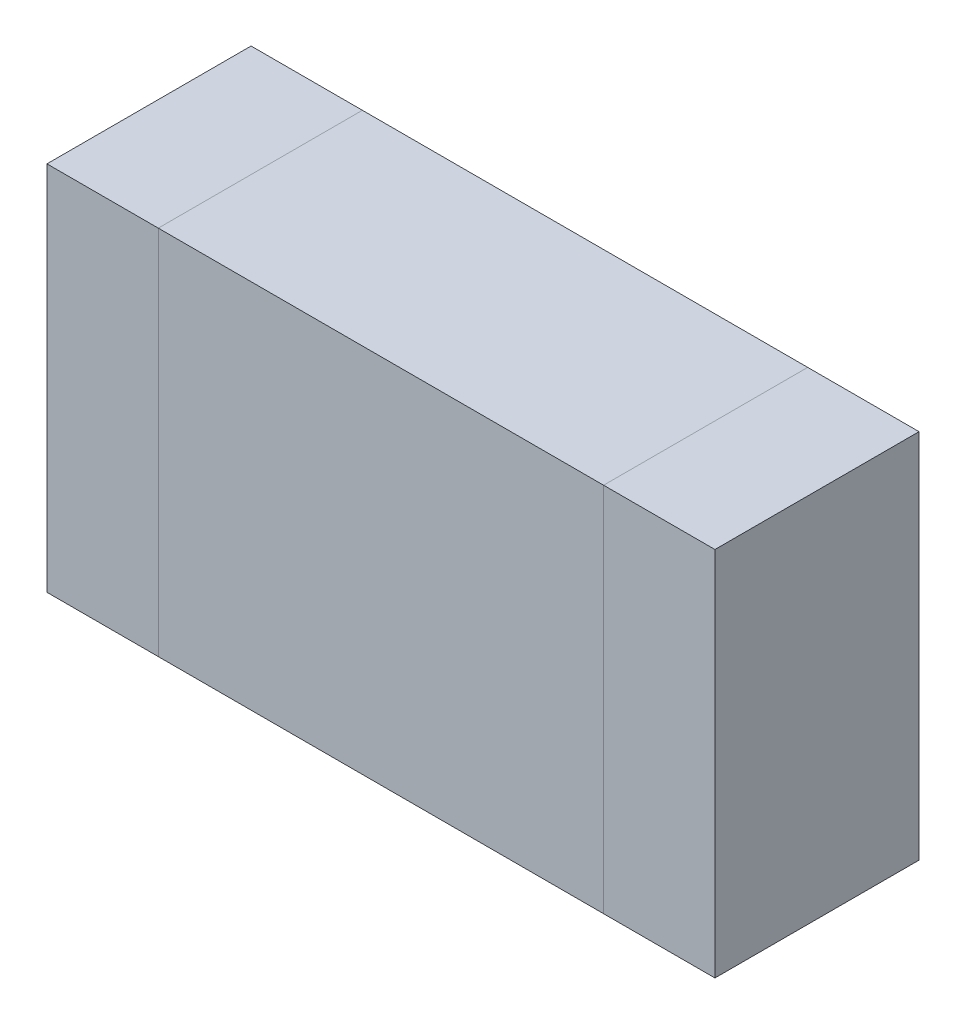
ISO-10303-21;
HEADER;
FILE_DESCRIPTION(('STEP AP214'),'2;1');
FILE_NAME('part.step','',(''),(''),'','','');
FILE_SCHEMA(('AUTOMOTIVE_DESIGN { 1 0 10303 214 1 1 1 1 }'));
ENDSEC;
DATA;
#1=APPLICATION_CONTEXT('core data for automotive mechanical design processes');
#2=APPLICATION_PROTOCOL_DEFINITION('international standard','automotive_design',2000,#1);
#3=PRODUCT_CONTEXT('',#1,'mechanical');
#4=PRODUCT('Part','Part','',(#3));
#5=PRODUCT_RELATED_PRODUCT_CATEGORY('part','',(#4));
#6=PRODUCT_DEFINITION_FORMATION('','',#4);
#7=PRODUCT_DEFINITION_CONTEXT('part definition',#1,'design');
#8=PRODUCT_DEFINITION('design','',#6,#7);
#9=PRODUCT_DEFINITION_SHAPE('','',#8);
#10=(LENGTH_UNIT() NAMED_UNIT(*) SI_UNIT(.MILLI.,.METRE.));
#11=(NAMED_UNIT(*) PLANE_ANGLE_UNIT() SI_UNIT($,.RADIAN.));
#12=(NAMED_UNIT(*) SI_UNIT($,.STERADIAN.) SOLID_ANGLE_UNIT());
#13=UNCERTAINTY_MEASURE_WITH_UNIT(LENGTH_MEASURE(1.E-05),#10,'distance_accuracy_value','');
#14=(GEOMETRIC_REPRESENTATION_CONTEXT(3) GLOBAL_UNCERTAINTY_ASSIGNED_CONTEXT((#13)) GLOBAL_UNIT_ASSIGNED_CONTEXT((#10,
#11,#12)) REPRESENTATION_CONTEXT('',''));
#15=CARTESIAN_POINT('',(0.,0.,0.));
#16=DIRECTION('',(0.,0.,1.));
#17=DIRECTION('',(1.,0.,0.));
#18=AXIS2_PLACEMENT_3D('',#15,#16,#17);
#19=CARTESIAN_POINT('',(-0.5999988,0.50000154,0.));
#20=DIRECTION('',(1.,0.,0.));
#21=DIRECTION('',(0.,-1.,0.));
#22=AXIS2_PLACEMENT_3D('',#19,#20,#21);
#23=PLANE('',#22);
#24=DIRECTION('',(0.,-1.,0.));
#25=VECTOR('',#24,1.);
#26=CARTESIAN_POINT('',(-0.5999988,0.50000154,0.));
#27=LINE('',#26,#25);
#28=CARTESIAN_POINT('',(-0.5999988,0.50000154,0.));
#29=VERTEX_POINT('',#28);
#30=CARTESIAN_POINT('',(-0.5999988,-0.499999,0.));
#31=VERTEX_POINT('',#30);
#32=EDGE_CURVE('P0_E11',#29,#31,#27,.T.);
#33=ORIENTED_EDGE('',*,*,#32,.T.);
#34=DIRECTION('',(0.,0.,1.));
#35=VECTOR('',#34,1.);
#36=CARTESIAN_POINT('',(-0.5999988,-0.499999,0.));
#37=LINE('',#36,#35);
#38=CARTESIAN_POINT('',(-0.5999988,-0.499999,0.5499989));
#39=VERTEX_POINT('',#38);
#40=EDGE_CURVE('P0_E24',#31,#39,#37,.T.);
#41=ORIENTED_EDGE('',*,*,#40,.T.);
#42=DIRECTION('',(0.,-1.,0.));
#43=VECTOR('',#42,1.);
#44=CARTESIAN_POINT('',(-0.5999988,0.50000154,0.5499989));
#45=LINE('',#44,#43);
#46=CARTESIAN_POINT('',(-0.5999988,0.50000154,0.5499989));
#47=VERTEX_POINT('',#46);
#48=EDGE_CURVE('P0_E87',#47,#39,#45,.T.);
#49=ORIENTED_EDGE('',*,*,#48,.F.);
#50=DIRECTION('',(0.,0.,1.));
#51=VECTOR('',#50,1.);
#52=CARTESIAN_POINT('',(-0.5999988,0.50000154,0.));
#53=LINE('',#52,#51);
#54=EDGE_CURVE('P0_E36',#29,#47,#53,.T.);
#55=ORIENTED_EDGE('',*,*,#54,.F.);
#56=EDGE_LOOP('',(#33,#41,#49,#55));
#57=FACE_BOUND('',#56,.T.);
#58=ADVANCED_FACE('P0_F17',(#57),#23,.F.);
#59=CARTESIAN_POINT('',(-0.5999988,-0.499999,0.));
#60=DIRECTION('',(0.,1.,0.));
#61=DIRECTION('',(1.,0.,0.));
#62=AXIS2_PLACEMENT_3D('',#59,#60,#61);
#63=PLANE('',#62);
#64=DIRECTION('',(1.,0.,0.));
#65=VECTOR('',#64,1.);
#66=CARTESIAN_POINT('',(-0.5999988,-0.499999,0.));
#67=LINE('',#66,#65);
#68=CARTESIAN_POINT('',(0.60000134,-0.499999,0.));
#69=VERTEX_POINT('',#68);
#70=EDGE_CURVE('P0_E84',#31,#69,#67,.T.);
#71=ORIENTED_EDGE('',*,*,#70,.T.);
#72=DIRECTION('',(0.,0.,1.));
#73=VECTOR('',#72,1.);
#74=CARTESIAN_POINT('',(0.60000134,-0.499999,0.));
#75=LINE('',#74,#73);
#76=CARTESIAN_POINT('',(0.60000134,-0.499999,0.5499989));
#77=VERTEX_POINT('',#76);
#78=EDGE_CURVE('P0_E82',#69,#77,#75,.T.);
#79=ORIENTED_EDGE('',*,*,#78,.T.);
#80=DIRECTION('',(1.,0.,0.));
#81=VECTOR('',#80,1.);
#82=CARTESIAN_POINT('',(-0.5999988,-0.499999,0.5499989));
#83=LINE('',#82,#81);
#84=EDGE_CURVE('P0_E62',#39,#77,#83,.T.);
#85=ORIENTED_EDGE('',*,*,#84,.F.);
#86=ORIENTED_EDGE('',*,*,#40,.F.);
#87=EDGE_LOOP('',(#71,#79,#85,#86));
#88=FACE_BOUND('',#87,.T.);
#89=ADVANCED_FACE('P0_F89',(#88),#63,.F.);
#90=CARTESIAN_POINT('',(0.60000134,-0.499999,0.));
#91=DIRECTION('',(-1.,0.,0.));
#92=DIRECTION('',(0.,1.,0.));
#93=AXIS2_PLACEMENT_3D('',#90,#91,#92);
#94=PLANE('',#93);
#95=DIRECTION('',(0.,1.,0.));
#96=VECTOR('',#95,1.);
#97=CARTESIAN_POINT('',(0.60000134,-0.499999,0.));
#98=LINE('',#97,#96);
#99=CARTESIAN_POINT('',(0.60000134,0.50000154,0.));
#100=VERTEX_POINT('',#99);
#101=EDGE_CURVE('P0_E71',#69,#100,#98,.T.);
#102=ORIENTED_EDGE('',*,*,#101,.T.);
#103=DIRECTION('',(0.,0.,1.));
#104=VECTOR('',#103,1.);
#105=CARTESIAN_POINT('',(0.60000134,0.50000154,0.));
#106=LINE('',#105,#104);
#107=CARTESIAN_POINT('',(0.60000134,0.50000154,0.5499989));
#108=VERTEX_POINT('',#107);
#109=EDGE_CURVE('P0_E65',#100,#108,#106,.T.);
#110=ORIENTED_EDGE('',*,*,#109,.T.);
#111=DIRECTION('',(0.,1.,0.));
#112=VECTOR('',#111,1.);
#113=CARTESIAN_POINT('',(0.60000134,-0.499999,0.5499989));
#114=LINE('',#113,#112);
#115=EDGE_CURVE('P0_E57',#77,#108,#114,.T.);
#116=ORIENTED_EDGE('',*,*,#115,.F.);
#117=ORIENTED_EDGE('',*,*,#78,.F.);
#118=EDGE_LOOP('',(#102,#110,#116,#117));
#119=FACE_BOUND('',#118,.T.);
#120=ADVANCED_FACE('P0_F69',(#119),#94,.F.);
#121=CARTESIAN_POINT('',(0.60000134,0.50000154,0.));
#122=DIRECTION('',(0.,-1.,0.));
#123=DIRECTION('',(-1.,0.,0.));
#124=AXIS2_PLACEMENT_3D('',#121,#122,#123);
#125=PLANE('',#124);
#126=DIRECTION('',(-1.,0.,0.));
#127=VECTOR('',#126,1.);
#128=CARTESIAN_POINT('',(0.60000134,0.50000154,0.));
#129=LINE('',#128,#127);
#130=EDGE_CURVE('P0_E66',#100,#29,#129,.T.);
#131=ORIENTED_EDGE('',*,*,#130,.T.);
#132=ORIENTED_EDGE('',*,*,#54,.T.);
#133=DIRECTION('',(-1.,0.,0.));
#134=VECTOR('',#133,1.);
#135=CARTESIAN_POINT('',(0.60000134,0.50000154,0.5499989));
#136=LINE('',#135,#134);
#137=EDGE_CURVE('P0_E61',#108,#47,#136,.T.);
#138=ORIENTED_EDGE('',*,*,#137,.F.);
#139=ORIENTED_EDGE('',*,*,#109,.F.);
#140=EDGE_LOOP('',(#131,#132,#138,#139));
#141=FACE_BOUND('',#140,.T.);
#142=ADVANCED_FACE('P0_F76',(#141),#125,.F.);
#143=CARTESIAN_POINT('',(1.270000012699E-06,1.270000012699E-06,0.));
#144=DIRECTION('',(0.,0.,1.));
#145=DIRECTION('',(1.,0.,0.));
#146=AXIS2_PLACEMENT_3D('',#143,#144,#145);
#147=PLANE('',#146);
#148=ORIENTED_EDGE('',*,*,#130,.F.);
#149=ORIENTED_EDGE('',*,*,#101,.F.);
#150=ORIENTED_EDGE('',*,*,#70,.F.);
#151=ORIENTED_EDGE('',*,*,#32,.F.);
#152=EDGE_LOOP('',(#148,#149,#150,#151));
#153=FACE_BOUND('',#152,.T.);
#154=ADVANCED_FACE('P0_F91',(#153),#147,.F.);
#155=CARTESIAN_POINT('',(1.270000012699E-06,1.270000012699E-06,0.5499989));
#156=DIRECTION('',(0.,0.,1.));
#157=DIRECTION('',(1.,0.,0.));
#158=AXIS2_PLACEMENT_3D('',#155,#156,#157);
#159=PLANE('',#158);
#160=ORIENTED_EDGE('',*,*,#48,.T.);
#161=ORIENTED_EDGE('',*,*,#84,.T.);
#162=ORIENTED_EDGE('',*,*,#115,.T.);
#163=ORIENTED_EDGE('',*,*,#137,.T.);
#164=EDGE_LOOP('',(#160,#161,#162,#163));
#165=FACE_BOUND('',#164,.T.);
#166=ADVANCED_FACE('P0_F59',(#165),#159,.T.);
#167=CLOSED_SHELL('',(#58,#89,#120,#142,#154,#166));
#168=MANIFOLD_SOLID_BREP('P0_B1',#167);
#169=CARTESIAN_POINT('',(-0.8999982,0.50000154,0.));
#170=DIRECTION('',(1.,0.,0.));
#171=DIRECTION('',(0.,-1.,0.));
#172=AXIS2_PLACEMENT_3D('',#169,#170,#171);
#173=PLANE('',#172);
#174=DIRECTION('',(0.,-1.,0.));
#175=VECTOR('',#174,1.);
#176=CARTESIAN_POINT('',(-0.8999982,0.50000154,0.));
#177=LINE('',#176,#175);
#178=CARTESIAN_POINT('',(-0.8999982,0.50000154,0.));
#179=VERTEX_POINT('',#178);
#180=CARTESIAN_POINT('',(-0.8999982,-0.499999,0.));
#181=VERTEX_POINT('',#180);
#182=EDGE_CURVE('P1_E11',#179,#181,#177,.T.);
#183=ORIENTED_EDGE('',*,*,#182,.T.);
#184=DIRECTION('',(0.,0.,1.));
#185=VECTOR('',#184,1.);
#186=CARTESIAN_POINT('',(-0.8999982,-0.499999,0.));
#187=LINE('',#186,#185);
#188=CARTESIAN_POINT('',(-0.8999982,-0.499999,0.5499989));
#189=VERTEX_POINT('',#188);
#190=EDGE_CURVE('P1_E24',#181,#189,#187,.T.);
#191=ORIENTED_EDGE('',*,*,#190,.T.);
#192=DIRECTION('',(0.,-1.,0.));
#193=VECTOR('',#192,1.);
#194=CARTESIAN_POINT('',(-0.8999982,0.50000154,0.5499989));
#195=LINE('',#194,#193);
#196=CARTESIAN_POINT('',(-0.8999982,0.50000154,0.5499989));
#197=VERTEX_POINT('',#196);
#198=EDGE_CURVE('P1_E87',#197,#189,#195,.T.);
#199=ORIENTED_EDGE('',*,*,#198,.F.);
#200=DIRECTION('',(0.,0.,1.));
#201=VECTOR('',#200,1.);
#202=CARTESIAN_POINT('',(-0.8999982,0.50000154,0.));
#203=LINE('',#202,#201);
#204=EDGE_CURVE('P1_E36',#179,#197,#203,.T.);
#205=ORIENTED_EDGE('',*,*,#204,.F.);
#206=EDGE_LOOP('',(#183,#191,#199,#205));
#207=FACE_BOUND('',#206,.T.);
#208=ADVANCED_FACE('P1_F17',(#207),#173,.F.);
#209=CARTESIAN_POINT('',(-0.8999982,-0.499999,0.));
#210=DIRECTION('',(0.,1.,0.));
#211=DIRECTION('',(1.,0.,0.));
#212=AXIS2_PLACEMENT_3D('',#209,#210,#211);
#213=PLANE('',#212);
#214=DIRECTION('',(1.,0.,0.));
#215=VECTOR('',#214,1.);
#216=CARTESIAN_POINT('',(-0.8999982,-0.499999,0.));
#217=LINE('',#216,#215);
#218=CARTESIAN_POINT('',(-0.5999988,-0.499999,0.));
#219=VERTEX_POINT('',#218);
#220=EDGE_CURVE('P1_E84',#181,#219,#217,.T.);
#221=ORIENTED_EDGE('',*,*,#220,.T.);
#222=DIRECTION('',(0.,0.,1.));
#223=VECTOR('',#222,1.);
#224=CARTESIAN_POINT('',(-0.5999988,-0.499999,0.));
#225=LINE('',#224,#223);
#226=CARTESIAN_POINT('',(-0.5999988,-0.499999,0.5499989));
#227=VERTEX_POINT('',#226);
#228=EDGE_CURVE('P1_E82',#219,#227,#225,.T.);
#229=ORIENTED_EDGE('',*,*,#228,.T.);
#230=DIRECTION('',(1.,0.,0.));
#231=VECTOR('',#230,1.);
#232=CARTESIAN_POINT('',(-0.8999982,-0.499999,0.5499989));
#233=LINE('',#232,#231);
#234=EDGE_CURVE('P1_E62',#189,#227,#233,.T.);
#235=ORIENTED_EDGE('',*,*,#234,.F.);
#236=ORIENTED_EDGE('',*,*,#190,.F.);
#237=EDGE_LOOP('',(#221,#229,#235,#236));
#238=FACE_BOUND('',#237,.T.);
#239=ADVANCED_FACE('P1_F89',(#238),#213,.F.);
#240=CARTESIAN_POINT('',(-0.5999988,-0.499999,0.));
#241=DIRECTION('',(-1.,0.,0.));
#242=DIRECTION('',(0.,1.,0.));
#243=AXIS2_PLACEMENT_3D('',#240,#241,#242);
#244=PLANE('',#243);
#245=DIRECTION('',(0.,1.,0.));
#246=VECTOR('',#245,1.);
#247=CARTESIAN_POINT('',(-0.5999988,-0.499999,0.));
#248=LINE('',#247,#246);
#249=CARTESIAN_POINT('',(-0.5999988,0.50000154,0.));
#250=VERTEX_POINT('',#249);
#251=EDGE_CURVE('P1_E71',#219,#250,#248,.T.);
#252=ORIENTED_EDGE('',*,*,#251,.T.);
#253=DIRECTION('',(0.,0.,1.));
#254=VECTOR('',#253,1.);
#255=CARTESIAN_POINT('',(-0.5999988,0.50000154,0.));
#256=LINE('',#255,#254);
#257=CARTESIAN_POINT('',(-0.5999988,0.50000154,0.5499989));
#258=VERTEX_POINT('',#257);
#259=EDGE_CURVE('P1_E65',#250,#258,#256,.T.);
#260=ORIENTED_EDGE('',*,*,#259,.T.);
#261=DIRECTION('',(0.,1.,0.));
#262=VECTOR('',#261,1.);
#263=CARTESIAN_POINT('',(-0.5999988,-0.499999,0.5499989));
#264=LINE('',#263,#262);
#265=EDGE_CURVE('P1_E57',#227,#258,#264,.T.);
#266=ORIENTED_EDGE('',*,*,#265,.F.);
#267=ORIENTED_EDGE('',*,*,#228,.F.);
#268=EDGE_LOOP('',(#252,#260,#266,#267));
#269=FACE_BOUND('',#268,.T.);
#270=ADVANCED_FACE('P1_F69',(#269),#244,.F.);
#271=CARTESIAN_POINT('',(-0.5999988,0.50000154,0.));
#272=DIRECTION('',(0.,-1.,0.));
#273=DIRECTION('',(-1.,0.,0.));
#274=AXIS2_PLACEMENT_3D('',#271,#272,#273);
#275=PLANE('',#274);
#276=DIRECTION('',(-1.,0.,0.));
#277=VECTOR('',#276,1.);
#278=CARTESIAN_POINT('',(-0.5999988,0.50000154,0.));
#279=LINE('',#278,#277);
#280=EDGE_CURVE('P1_E66',#250,#179,#279,.T.);
#281=ORIENTED_EDGE('',*,*,#280,.T.);
#282=ORIENTED_EDGE('',*,*,#204,.T.);
#283=DIRECTION('',(-1.,0.,0.));
#284=VECTOR('',#283,1.);
#285=CARTESIAN_POINT('',(-0.5999988,0.50000154,0.5499989));
#286=LINE('',#285,#284);
#287=EDGE_CURVE('P1_E61',#258,#197,#286,.T.);
#288=ORIENTED_EDGE('',*,*,#287,.F.);
#289=ORIENTED_EDGE('',*,*,#259,.F.);
#290=EDGE_LOOP('',(#281,#282,#288,#289));
#291=FACE_BOUND('',#290,.T.);
#292=ADVANCED_FACE('P1_F76',(#291),#275,.F.);
#293=CARTESIAN_POINT('',(-0.7499985,1.270000012716E-06,0.));
#294=DIRECTION('',(0.,0.,1.));
#295=DIRECTION('',(1.,0.,0.));
#296=AXIS2_PLACEMENT_3D('',#293,#294,#295);
#297=PLANE('',#296);
#298=ORIENTED_EDGE('',*,*,#280,.F.);
#299=ORIENTED_EDGE('',*,*,#251,.F.);
#300=ORIENTED_EDGE('',*,*,#220,.F.);
#301=ORIENTED_EDGE('',*,*,#182,.F.);
#302=EDGE_LOOP('',(#298,#299,#300,#301));
#303=FACE_BOUND('',#302,.T.);
#304=ADVANCED_FACE('P1_F91',(#303),#297,.F.);
#305=CARTESIAN_POINT('',(-0.7499985,1.270000012716E-06,0.5499989));
#306=DIRECTION('',(0.,0.,1.));
#307=DIRECTION('',(1.,0.,0.));
#308=AXIS2_PLACEMENT_3D('',#305,#306,#307);
#309=PLANE('',#308);
#310=ORIENTED_EDGE('',*,*,#198,.T.);
#311=ORIENTED_EDGE('',*,*,#234,.T.);
#312=ORIENTED_EDGE('',*,*,#265,.T.);
#313=ORIENTED_EDGE('',*,*,#287,.T.);
#314=EDGE_LOOP('',(#310,#311,#312,#313));
#315=FACE_BOUND('',#314,.T.);
#316=ADVANCED_FACE('P1_F59',(#315),#309,.T.);
#317=CLOSED_SHELL('',(#208,#239,#270,#292,#304,#316));
#318=MANIFOLD_SOLID_BREP('P1_B1',#317);
#319=CARTESIAN_POINT('',(0.60000134,0.50000154,0.));
#320=DIRECTION('',(1.,0.,0.));
#321=DIRECTION('',(0.,-1.,0.));
#322=AXIS2_PLACEMENT_3D('',#319,#320,#321);
#323=PLANE('',#322);
#324=DIRECTION('',(0.,-1.,0.));
#325=VECTOR('',#324,1.);
#326=CARTESIAN_POINT('',(0.60000134,0.50000154,0.));
#327=LINE('',#326,#325);
#328=CARTESIAN_POINT('',(0.60000134,0.50000154,0.));
#329=VERTEX_POINT('',#328);
#330=CARTESIAN_POINT('',(0.60000134,-0.499999,0.));
#331=VERTEX_POINT('',#330);
#332=EDGE_CURVE('P2_E10',#329,#331,#327,.T.);
#333=ORIENTED_EDGE('',*,*,#332,.T.);
#334=DIRECTION('',(0.,0.,1.));
#335=VECTOR('',#334,1.);
#336=CARTESIAN_POINT('',(0.60000134,-0.499999,0.));
#337=LINE('',#336,#335);
#338=CARTESIAN_POINT('',(0.60000134,-0.499999,0.5499989));
#339=VERTEX_POINT('',#338);
#340=EDGE_CURVE('P2_E23',#331,#339,#337,.T.);
#341=ORIENTED_EDGE('',*,*,#340,.T.);
#342=DIRECTION('',(0.,-1.,0.));
#343=VECTOR('',#342,1.);
#344=CARTESIAN_POINT('',(0.60000134,0.50000154,0.5499989));
#345=LINE('',#344,#343);
#346=CARTESIAN_POINT('',(0.60000134,0.50000154,0.5499989));
#347=VERTEX_POINT('',#346);
#348=EDGE_CURVE('P2_E86',#347,#339,#345,.T.);
#349=ORIENTED_EDGE('',*,*,#348,.F.);
#350=DIRECTION('',(0.,0.,1.));
#351=VECTOR('',#350,1.);
#352=CARTESIAN_POINT('',(0.60000134,0.50000154,0.));
#353=LINE('',#352,#351);
#354=EDGE_CURVE('P2_E37',#329,#347,#353,.T.);
#355=ORIENTED_EDGE('',*,*,#354,.F.);
#356=EDGE_LOOP('',(#333,#341,#349,#355));
#357=FACE_BOUND('',#356,.T.);
#358=ADVANCED_FACE('P2_F16',(#357),#323,.F.);
#359=CARTESIAN_POINT('',(0.60000134,-0.499999,0.));
#360=DIRECTION('',(0.,1.,0.));
#361=DIRECTION('',(1.,0.,0.));
#362=AXIS2_PLACEMENT_3D('',#359,#360,#361);
#363=PLANE('',#362);
#364=DIRECTION('',(1.,0.,0.));
#365=VECTOR('',#364,1.);
#366=CARTESIAN_POINT('',(0.60000134,-0.499999,0.));
#367=LINE('',#366,#365);
#368=CARTESIAN_POINT('',(0.90000074,-0.499999,0.));
#369=VERTEX_POINT('',#368);
#370=EDGE_CURVE('P2_E30',#331,#369,#367,.T.);
#371=ORIENTED_EDGE('',*,*,#370,.T.);
#372=DIRECTION('',(0.,0.,1.));
#373=VECTOR('',#372,1.);
#374=CARTESIAN_POINT('',(0.90000074,-0.499999,0.));
#375=LINE('',#374,#373);
#376=CARTESIAN_POINT('',(0.90000074,-0.499999,0.5499989));
#377=VERTEX_POINT('',#376);
#378=EDGE_CURVE('P2_E82',#369,#377,#375,.T.);
#379=ORIENTED_EDGE('',*,*,#378,.T.);
#380=DIRECTION('',(1.,0.,0.));
#381=VECTOR('',#380,1.);
#382=CARTESIAN_POINT('',(0.60000134,-0.499999,0.5499989));
#383=LINE('',#382,#381);
#384=EDGE_CURVE('P2_E62',#339,#377,#383,.T.);
#385=ORIENTED_EDGE('',*,*,#384,.F.);
#386=ORIENTED_EDGE('',*,*,#340,.F.);
#387=EDGE_LOOP('',(#371,#379,#385,#386));
#388=FACE_BOUND('',#387,.T.);
#389=ADVANCED_FACE('P2_F89',(#388),#363,.F.);
#390=CARTESIAN_POINT('',(0.90000074,-0.499999,0.));
#391=DIRECTION('',(-1.,0.,0.));
#392=DIRECTION('',(0.,1.,0.));
#393=AXIS2_PLACEMENT_3D('',#390,#391,#392);
#394=PLANE('',#393);
#395=DIRECTION('',(0.,1.,0.));
#396=VECTOR('',#395,1.);
#397=CARTESIAN_POINT('',(0.90000074,-0.499999,0.));
#398=LINE('',#397,#396);
#399=CARTESIAN_POINT('',(0.90000074,0.50000154,0.));
#400=VERTEX_POINT('',#399);
#401=EDGE_CURVE('P2_E71',#369,#400,#398,.T.);
#402=ORIENTED_EDGE('',*,*,#401,.T.);
#403=DIRECTION('',(0.,0.,1.));
#404=VECTOR('',#403,1.);
#405=CARTESIAN_POINT('',(0.90000074,0.50000154,0.));
#406=LINE('',#405,#404);
#407=CARTESIAN_POINT('',(0.90000074,0.50000154,0.5499989));
#408=VERTEX_POINT('',#407);
#409=EDGE_CURVE('P2_E66',#400,#408,#406,.T.);
#410=ORIENTED_EDGE('',*,*,#409,.T.);
#411=DIRECTION('',(0.,1.,0.));
#412=VECTOR('',#411,1.);
#413=CARTESIAN_POINT('',(0.90000074,-0.499999,0.5499989));
#414=LINE('',#413,#412);
#415=EDGE_CURVE('P2_E56',#377,#408,#414,.T.);
#416=ORIENTED_EDGE('',*,*,#415,.F.);
#417=ORIENTED_EDGE('',*,*,#378,.F.);
#418=EDGE_LOOP('',(#402,#410,#416,#417));
#419=FACE_BOUND('',#418,.T.);
#420=ADVANCED_FACE('P2_F70',(#419),#394,.F.);
#421=CARTESIAN_POINT('',(0.90000074,0.50000154,0.));
#422=DIRECTION('',(0.,-1.,0.));
#423=DIRECTION('',(-1.,0.,0.));
#424=AXIS2_PLACEMENT_3D('',#421,#422,#423);
#425=PLANE('',#424);
#426=DIRECTION('',(-1.,0.,0.));
#427=VECTOR('',#426,1.);
#428=CARTESIAN_POINT('',(0.90000074,0.50000154,0.));
#429=LINE('',#428,#427);
#430=EDGE_CURVE('P2_E67',#400,#329,#429,.T.);
#431=ORIENTED_EDGE('',*,*,#430,.T.);
#432=ORIENTED_EDGE('',*,*,#354,.T.);
#433=DIRECTION('',(-1.,0.,0.));
#434=VECTOR('',#433,1.);
#435=CARTESIAN_POINT('',(0.90000074,0.50000154,0.5499989));
#436=LINE('',#435,#434);
#437=EDGE_CURVE('P2_E60',#408,#347,#436,.T.);
#438=ORIENTED_EDGE('',*,*,#437,.F.);
#439=ORIENTED_EDGE('',*,*,#409,.F.);
#440=EDGE_LOOP('',(#431,#432,#438,#439));
#441=FACE_BOUND('',#440,.T.);
#442=ADVANCED_FACE('P2_F76',(#441),#425,.F.);
#443=CARTESIAN_POINT('',(0.75000104,1.270000012716E-06,0.));
#444=DIRECTION('',(0.,0.,1.));
#445=DIRECTION('',(1.,0.,0.));
#446=AXIS2_PLACEMENT_3D('',#443,#444,#445);
#447=PLANE('',#446);
#448=ORIENTED_EDGE('',*,*,#430,.F.);
#449=ORIENTED_EDGE('',*,*,#401,.F.);
#450=ORIENTED_EDGE('',*,*,#370,.F.);
#451=ORIENTED_EDGE('',*,*,#332,.F.);
#452=EDGE_LOOP('',(#448,#449,#450,#451));
#453=FACE_BOUND('',#452,.T.);
#454=ADVANCED_FACE('P2_F90',(#453),#447,.F.);
#455=CARTESIAN_POINT('',(0.75000104,1.270000012716E-06,0.5499989));
#456=DIRECTION('',(0.,0.,1.));
#457=DIRECTION('',(1.,0.,0.));
#458=AXIS2_PLACEMENT_3D('',#455,#456,#457);
#459=PLANE('',#458);
#460=ORIENTED_EDGE('',*,*,#348,.T.);
#461=ORIENTED_EDGE('',*,*,#384,.T.);
#462=ORIENTED_EDGE('',*,*,#415,.T.);
#463=ORIENTED_EDGE('',*,*,#437,.T.);
#464=EDGE_LOOP('',(#460,#461,#462,#463));
#465=FACE_BOUND('',#464,.T.);
#466=ADVANCED_FACE('P2_F58',(#465),#459,.T.);
#467=CLOSED_SHELL('',(#358,#389,#420,#442,#454,#466));
#468=MANIFOLD_SOLID_BREP('P2_B1',#467);
#469=ADVANCED_BREP_SHAPE_REPRESENTATION('',(#18,#168,#318,#468),#14);
#470=SHAPE_DEFINITION_REPRESENTATION(#9,#469);
ENDSEC;
END-ISO-10303-21;
